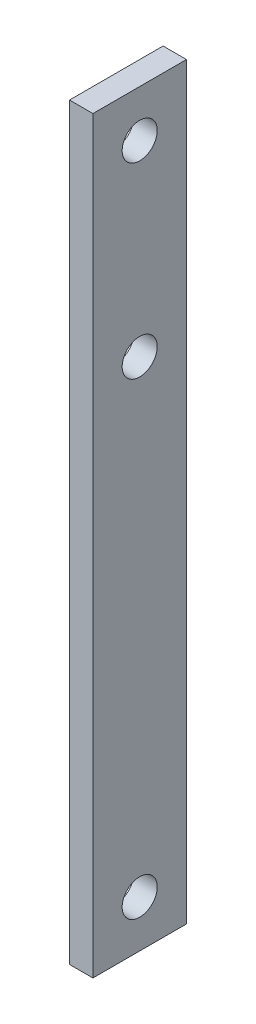
ISO-10303-21;
HEADER;
FILE_DESCRIPTION(('STEP AP214'),'2;1');
FILE_NAME('part.step','',(''),(''),'','','');
FILE_SCHEMA(('AUTOMOTIVE_DESIGN { 1 0 10303 214 1 1 1 1 }'));
ENDSEC;
DATA;
#1=APPLICATION_CONTEXT('core data for automotive mechanical design processes');
#2=APPLICATION_PROTOCOL_DEFINITION('international standard','automotive_design',2000,#1);
#3=PRODUCT_CONTEXT('',#1,'mechanical');
#4=PRODUCT('Part','Part','',(#3));
#5=PRODUCT_RELATED_PRODUCT_CATEGORY('part','',(#4));
#6=PRODUCT_DEFINITION_FORMATION('','',#4);
#7=PRODUCT_DEFINITION_CONTEXT('part definition',#1,'design');
#8=PRODUCT_DEFINITION('design','',#6,#7);
#9=PRODUCT_DEFINITION_SHAPE('','',#8);
#10=(LENGTH_UNIT() NAMED_UNIT(*) SI_UNIT(.MILLI.,.METRE.));
#11=(NAMED_UNIT(*) PLANE_ANGLE_UNIT() SI_UNIT($,.RADIAN.));
#12=(NAMED_UNIT(*) SI_UNIT($,.STERADIAN.) SOLID_ANGLE_UNIT());
#13=UNCERTAINTY_MEASURE_WITH_UNIT(LENGTH_MEASURE(1.E-05),#10,'distance_accuracy_value','');
#14=(GEOMETRIC_REPRESENTATION_CONTEXT(3) GLOBAL_UNCERTAINTY_ASSIGNED_CONTEXT((#13)) GLOBAL_UNIT_ASSIGNED_CONTEXT((#10,
#11,#12)) REPRESENTATION_CONTEXT('',''));
#15=CARTESIAN_POINT('',(0.,0.,0.));
#16=DIRECTION('',(0.,0.,1.));
#17=DIRECTION('',(1.,0.,0.));
#18=AXIS2_PLACEMENT_3D('',#15,#16,#17);
#19=CARTESIAN_POINT('',(6.35,-203.2,-25.4));
#20=DIRECTION('',(0.,0.,1.));
#21=DIRECTION('',(1.,0.,0.));
#22=AXIS2_PLACEMENT_3D('',#19,#20,#21);
#23=PLANE('',#22);
#24=DIRECTION('',(0.,1.,0.));
#25=VECTOR('',#24,1.);
#26=CARTESIAN_POINT('',(-6.35,-203.2,-25.4));
#27=LINE('',#26,#25);
#28=CARTESIAN_POINT('',(-6.35,-203.2,-25.4));
#29=VERTEX_POINT('',#28);
#30=CARTESIAN_POINT('',(-6.35,203.2,-25.4));
#31=VERTEX_POINT('',#30);
#32=EDGE_CURVE('E96',#29,#31,#27,.T.);
#33=ORIENTED_EDGE('',*,*,#32,.T.);
#34=DIRECTION('',(-1.,0.,0.));
#35=VECTOR('',#34,1.);
#36=CARTESIAN_POINT('',(6.35,203.2,-25.4));
#37=LINE('',#36,#35);
#38=CARTESIAN_POINT('',(6.35,203.2,-25.4));
#39=VERTEX_POINT('',#38);
#40=EDGE_CURVE('E11',#39,#31,#37,.T.);
#41=ORIENTED_EDGE('',*,*,#40,.F.);
#42=DIRECTION('',(0.,1.,0.));
#43=VECTOR('',#42,1.);
#44=CARTESIAN_POINT('',(6.35,-203.2,-25.4));
#45=LINE('',#44,#43);
#46=CARTESIAN_POINT('',(6.35,-203.2,-25.4));
#47=VERTEX_POINT('',#46);
#48=EDGE_CURVE('E84',#47,#39,#45,.T.);
#49=ORIENTED_EDGE('',*,*,#48,.F.);
#50=DIRECTION('',(-1.,0.,0.));
#51=VECTOR('',#50,1.);
#52=CARTESIAN_POINT('',(6.35,-203.2,-25.4));
#53=LINE('',#52,#51);
#54=EDGE_CURVE('E92',#47,#29,#53,.T.);
#55=ORIENTED_EDGE('',*,*,#54,.T.);
#56=EDGE_LOOP('',(#33,#41,#49,#55));
#57=FACE_BOUND('',#56,.T.);
#58=ADVANCED_FACE('F33',(#57),#23,.F.);
#59=CARTESIAN_POINT('',(6.35,203.2,25.4));
#60=DIRECTION('',(0.,-1.,0.));
#61=DIRECTION('',(0.,0.,-1.));
#62=AXIS2_PLACEMENT_3D('',#59,#60,#61);
#63=PLANE('',#62);
#64=DIRECTION('',(0.,0.,1.));
#65=VECTOR('',#64,1.);
#66=CARTESIAN_POINT('',(-6.35,203.2,25.4));
#67=LINE('',#66,#65);
#68=CARTESIAN_POINT('',(-6.35,203.2,25.4));
#69=VERTEX_POINT('',#68);
#70=EDGE_CURVE('E88',#31,#69,#67,.T.);
#71=ORIENTED_EDGE('',*,*,#70,.T.);
#72=DIRECTION('',(-1.,0.,0.));
#73=VECTOR('',#72,1.);
#74=CARTESIAN_POINT('',(6.35,203.2,25.4));
#75=LINE('',#74,#73);
#76=CARTESIAN_POINT('',(6.35,203.2,25.4));
#77=VERTEX_POINT('',#76);
#78=EDGE_CURVE('E41',#77,#69,#75,.T.);
#79=ORIENTED_EDGE('',*,*,#78,.F.);
#80=DIRECTION('',(0.,0.,1.));
#81=VECTOR('',#80,1.);
#82=CARTESIAN_POINT('',(6.35,203.2,25.4));
#83=LINE('',#82,#81);
#84=EDGE_CURVE('E79',#39,#77,#83,.T.);
#85=ORIENTED_EDGE('',*,*,#84,.F.);
#86=ORIENTED_EDGE('',*,*,#40,.T.);
#87=EDGE_LOOP('',(#71,#79,#85,#86));
#88=FACE_BOUND('',#87,.T.);
#89=ADVANCED_FACE('F87',(#88),#63,.F.);
#90=CARTESIAN_POINT('',(6.35,-203.2,25.4));
#91=DIRECTION('',(0.,0.,-1.));
#92=DIRECTION('',(-1.,0.,0.));
#93=AXIS2_PLACEMENT_3D('',#90,#91,#92);
#94=PLANE('',#93);
#95=DIRECTION('',(0.,-1.,0.));
#96=VECTOR('',#95,1.);
#97=CARTESIAN_POINT('',(-6.35,-203.2,25.4));
#98=LINE('',#97,#96);
#99=CARTESIAN_POINT('',(-6.35,-203.2,25.4));
#100=VERTEX_POINT('',#99);
#101=EDGE_CURVE('E66',#69,#100,#98,.T.);
#102=ORIENTED_EDGE('',*,*,#101,.T.);
#103=DIRECTION('',(-1.,0.,0.));
#104=VECTOR('',#103,1.);
#105=CARTESIAN_POINT('',(6.35,-203.2,25.4));
#106=LINE('',#105,#104);
#107=CARTESIAN_POINT('',(6.35,-203.2,25.4));
#108=VERTEX_POINT('',#107);
#109=EDGE_CURVE('E89',#108,#100,#106,.T.);
#110=ORIENTED_EDGE('',*,*,#109,.F.);
#111=DIRECTION('',(0.,-1.,0.));
#112=VECTOR('',#111,1.);
#113=CARTESIAN_POINT('',(6.35,-203.2,25.4));
#114=LINE('',#113,#112);
#115=EDGE_CURVE('E82',#77,#108,#114,.T.);
#116=ORIENTED_EDGE('',*,*,#115,.F.);
#117=ORIENTED_EDGE('',*,*,#78,.T.);
#118=EDGE_LOOP('',(#102,#110,#116,#117));
#119=FACE_BOUND('',#118,.T.);
#120=ADVANCED_FACE('F90',(#119),#94,.F.);
#121=CARTESIAN_POINT('',(6.35,-203.2,25.4));
#122=DIRECTION('',(0.,1.,0.));
#123=DIRECTION('',(0.,0.,1.));
#124=AXIS2_PLACEMENT_3D('',#121,#122,#123);
#125=PLANE('',#124);
#126=DIRECTION('',(0.,0.,-1.));
#127=VECTOR('',#126,1.);
#128=CARTESIAN_POINT('',(-6.35,-203.2,25.4));
#129=LINE('',#128,#127);
#130=EDGE_CURVE('E72',#100,#29,#129,.T.);
#131=ORIENTED_EDGE('',*,*,#130,.T.);
#132=ORIENTED_EDGE('',*,*,#54,.F.);
#133=DIRECTION('',(0.,0.,-1.));
#134=VECTOR('',#133,1.);
#135=CARTESIAN_POINT('',(6.35,-203.2,25.4));
#136=LINE('',#135,#134);
#137=EDGE_CURVE('E49',#108,#47,#136,.T.);
#138=ORIENTED_EDGE('',*,*,#137,.F.);
#139=ORIENTED_EDGE('',*,*,#109,.T.);
#140=EDGE_LOOP('',(#131,#132,#138,#139));
#141=FACE_BOUND('',#140,.T.);
#142=ADVANCED_FACE('F104',(#141),#125,.F.);
#143=CARTESIAN_POINT('',(6.35,0.,0.));
#144=DIRECTION('',(-1.,0.,0.));
#145=DIRECTION('',(0.,0.,1.));
#146=AXIS2_PLACEMENT_3D('',#143,#144,#145);
#147=PLANE('',#146);
#148=CARTESIAN_POINT('',(6.35,76.2,0.));
#149=DIRECTION('',(1.,0.,0.));
#150=DIRECTION('',(0.,0.,-1.));
#151=AXIS2_PLACEMENT_3D('',#148,#149,#150);
#152=CIRCLE('',#151,9.525);
#153=CARTESIAN_POINT('',(6.35,76.2,-9.52500000000001));
#154=VERTEX_POINT('',#153);
#155=EDGE_CURVE('E119',#154,#154,#152,.T.);
#156=ORIENTED_EDGE('',*,*,#155,.F.);
#157=EDGE_LOOP('',(#156));
#158=FACE_BOUND('',#157,.T.);
#159=CARTESIAN_POINT('',(6.35,-177.8,0.));
#160=DIRECTION('',(1.,0.,0.));
#161=DIRECTION('',(0.,0.,-1.));
#162=AXIS2_PLACEMENT_3D('',#159,#160,#161);
#163=CIRCLE('',#162,9.525);
#164=CARTESIAN_POINT('',(6.35,-177.8,-9.52499999999999));
#165=VERTEX_POINT('',#164);
#166=EDGE_CURVE('E113',#165,#165,#163,.T.);
#167=ORIENTED_EDGE('',*,*,#166,.F.);
#168=EDGE_LOOP('',(#167));
#169=FACE_BOUND('',#168,.T.);
#170=CARTESIAN_POINT('',(6.35,177.8,0.));
#171=DIRECTION('',(1.,0.,0.));
#172=DIRECTION('',(0.,0.,-1.));
#173=AXIS2_PLACEMENT_3D('',#170,#171,#172);
#174=CIRCLE('',#173,9.52499999999998);
#175=CARTESIAN_POINT('',(6.35,177.8,-9.52499999999997));
#176=VERTEX_POINT('',#175);
#177=EDGE_CURVE('E99',#176,#176,#174,.T.);
#178=ORIENTED_EDGE('',*,*,#177,.F.);
#179=EDGE_LOOP('',(#178));
#180=FACE_BOUND('',#179,.T.);
#181=ORIENTED_EDGE('',*,*,#48,.T.);
#182=ORIENTED_EDGE('',*,*,#84,.T.);
#183=ORIENTED_EDGE('',*,*,#115,.T.);
#184=ORIENTED_EDGE('',*,*,#137,.T.);
#185=EDGE_LOOP('',(#181,#182,#183,#184));
#186=FACE_BOUND('',#185,.T.);
#187=ADVANCED_FACE('F80',(#158,#169,#180,#186),#147,.F.);
#188=CARTESIAN_POINT('',(-6.35,0.,0.));
#189=DIRECTION('',(-1.,0.,0.));
#190=DIRECTION('',(0.,0.,1.));
#191=AXIS2_PLACEMENT_3D('',#188,#189,#190);
#192=PLANE('',#191);
#193=CARTESIAN_POINT('',(-6.35,76.2,0.));
#194=DIRECTION('',(-1.,0.,0.));
#195=DIRECTION('',(0.,0.,1.));
#196=AXIS2_PLACEMENT_3D('',#193,#194,#195);
#197=CIRCLE('',#196,9.525);
#198=CARTESIAN_POINT('',(-6.35,76.2,9.52499999999999));
#199=VERTEX_POINT('',#198);
#200=EDGE_CURVE('E122',#199,#199,#197,.F.);
#201=ORIENTED_EDGE('',*,*,#200,.T.);
#202=EDGE_LOOP('',(#201));
#203=FACE_BOUND('',#202,.T.);
#204=CARTESIAN_POINT('',(-6.35,-177.8,0.));
#205=DIRECTION('',(-1.,0.,0.));
#206=DIRECTION('',(0.,0.,1.));
#207=AXIS2_PLACEMENT_3D('',#204,#205,#206);
#208=CIRCLE('',#207,9.525);
#209=CARTESIAN_POINT('',(-6.35,-177.8,9.52500000000001));
#210=VERTEX_POINT('',#209);
#211=EDGE_CURVE('E116',#210,#210,#208,.F.);
#212=ORIENTED_EDGE('',*,*,#211,.T.);
#213=EDGE_LOOP('',(#212));
#214=FACE_BOUND('',#213,.T.);
#215=CARTESIAN_POINT('',(-6.35,177.8,0.));
#216=DIRECTION('',(-1.,0.,0.));
#217=DIRECTION('',(0.,0.,1.));
#218=AXIS2_PLACEMENT_3D('',#215,#216,#217);
#219=CIRCLE('',#218,9.52499999999998);
#220=CARTESIAN_POINT('',(-6.35,177.8,9.52499999999999));
#221=VERTEX_POINT('',#220);
#222=EDGE_CURVE('E110',#221,#221,#219,.F.);
#223=ORIENTED_EDGE('',*,*,#222,.T.);
#224=EDGE_LOOP('',(#223));
#225=FACE_BOUND('',#224,.T.);
#226=ORIENTED_EDGE('',*,*,#32,.F.);
#227=ORIENTED_EDGE('',*,*,#130,.F.);
#228=ORIENTED_EDGE('',*,*,#101,.F.);
#229=ORIENTED_EDGE('',*,*,#70,.F.);
#230=EDGE_LOOP('',(#226,#227,#228,#229));
#231=FACE_BOUND('',#230,.T.);
#232=ADVANCED_FACE('F107',(#203,#214,#225,#231),#192,.T.);
#233=CARTESIAN_POINT('',(-6.351,177.8,0.));
#234=DIRECTION('',(1.,0.,0.));
#235=DIRECTION('',(0.,0.,-1.));
#236=AXIS2_PLACEMENT_3D('',#233,#234,#235);
#237=CYLINDRICAL_SURFACE('',#236,9.52499999999998);
#238=ORIENTED_EDGE('',*,*,#222,.F.);
#239=EDGE_LOOP('',(#238));
#240=FACE_BOUND('',#239,.T.);
#241=ORIENTED_EDGE('',*,*,#177,.T.);
#242=EDGE_LOOP('',(#241));
#243=FACE_BOUND('',#242,.T.);
#244=ADVANCED_FACE('F137',(#240,#243),#237,.F.);
#245=CARTESIAN_POINT('',(-6.351,-177.8,0.));
#246=DIRECTION('',(1.,0.,0.));
#247=DIRECTION('',(0.,0.,-1.));
#248=AXIS2_PLACEMENT_3D('',#245,#246,#247);
#249=CYLINDRICAL_SURFACE('',#248,9.525);
#250=ORIENTED_EDGE('',*,*,#211,.F.);
#251=EDGE_LOOP('',(#250));
#252=FACE_BOUND('',#251,.T.);
#253=ORIENTED_EDGE('',*,*,#166,.T.);
#254=EDGE_LOOP('',(#253));
#255=FACE_BOUND('',#254,.T.);
#256=ADVANCED_FACE('F139',(#252,#255),#249,.F.);
#257=CARTESIAN_POINT('',(-6.351,76.2,0.));
#258=DIRECTION('',(1.,0.,0.));
#259=DIRECTION('',(0.,0.,-1.));
#260=AXIS2_PLACEMENT_3D('',#257,#258,#259);
#261=CYLINDRICAL_SURFACE('',#260,9.525);
#262=ORIENTED_EDGE('',*,*,#200,.F.);
#263=EDGE_LOOP('',(#262));
#264=FACE_BOUND('',#263,.T.);
#265=ORIENTED_EDGE('',*,*,#155,.T.);
#266=EDGE_LOOP('',(#265));
#267=FACE_BOUND('',#266,.T.);
#268=ADVANCED_FACE('F128',(#264,#267),#261,.F.);
#269=CLOSED_SHELL('',(#58,#89,#120,#142,#187,#232,#244,#256,#268));
#270=MANIFOLD_SOLID_BREP('B2',#269);
#271=ADVANCED_BREP_SHAPE_REPRESENTATION('',(#18,#270),#14);
#272=SHAPE_DEFINITION_REPRESENTATION(#9,#271);
ENDSEC;
END-ISO-10303-21;
